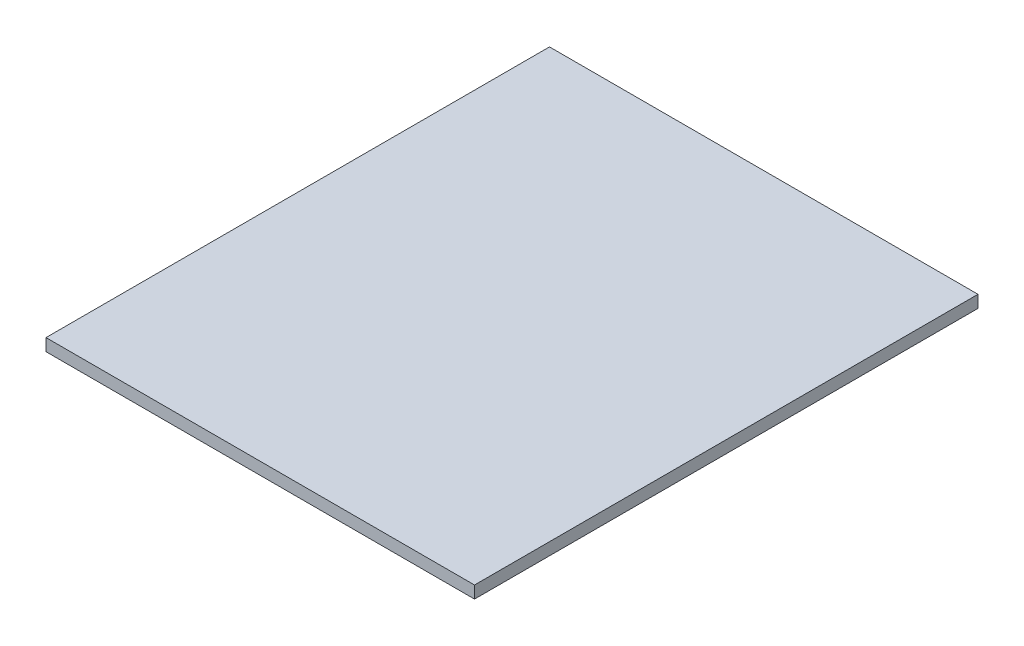
ISO-10303-21;
HEADER;
FILE_DESCRIPTION(('STEP AP214'),'2;1');
FILE_NAME('part.step','',(''),(''),'','','');
FILE_SCHEMA(('AUTOMOTIVE_DESIGN { 1 0 10303 214 1 1 1 1 }'));
ENDSEC;
DATA;
#1=APPLICATION_CONTEXT('core data for automotive mechanical design processes');
#2=APPLICATION_PROTOCOL_DEFINITION('international standard','automotive_design',2000,#1);
#3=PRODUCT_CONTEXT('',#1,'mechanical');
#4=PRODUCT('Part','Part','',(#3));
#5=PRODUCT_RELATED_PRODUCT_CATEGORY('part','',(#4));
#6=PRODUCT_DEFINITION_FORMATION('','',#4);
#7=PRODUCT_DEFINITION_CONTEXT('part definition',#1,'design');
#8=PRODUCT_DEFINITION('design','',#6,#7);
#9=PRODUCT_DEFINITION_SHAPE('','',#8);
#10=(LENGTH_UNIT() NAMED_UNIT(*) SI_UNIT(.MILLI.,.METRE.));
#11=(NAMED_UNIT(*) PLANE_ANGLE_UNIT() SI_UNIT($,.RADIAN.));
#12=(NAMED_UNIT(*) SI_UNIT($,.STERADIAN.) SOLID_ANGLE_UNIT());
#13=UNCERTAINTY_MEASURE_WITH_UNIT(LENGTH_MEASURE(1.E-05),#10,'distance_accuracy_value','');
#14=(GEOMETRIC_REPRESENTATION_CONTEXT(3) GLOBAL_UNCERTAINTY_ASSIGNED_CONTEXT((#13)) GLOBAL_UNIT_ASSIGNED_CONTEXT((#10,
#11,#12)) REPRESENTATION_CONTEXT('',''));
#15=CARTESIAN_POINT('',(0.,0.,0.));
#16=DIRECTION('',(0.,0.,1.));
#17=DIRECTION('',(1.,0.,0.));
#18=AXIS2_PLACEMENT_3D('',#15,#16,#17);
#19=CARTESIAN_POINT('',(0.,16.,0.));
#20=DIRECTION('',(1.,0.,0.));
#21=DIRECTION('',(0.,0.,-1.));
#22=AXIS2_PLACEMENT_3D('',#19,#20,#21);
#23=PLANE('',#22);
#24=DIRECTION('',(0.,0.,1.));
#25=VECTOR('',#24,1.);
#26=CARTESIAN_POINT('',(0.,0.,0.));
#27=LINE('',#26,#25);
#28=CARTESIAN_POINT('',(0.,0.,-658.));
#29=VERTEX_POINT('',#28);
#30=CARTESIAN_POINT('',(0.,0.,0.));
#31=VERTEX_POINT('',#30);
#32=EDGE_CURVE('E94',#29,#31,#27,.T.);
#33=ORIENTED_EDGE('',*,*,#32,.T.);
#34=DIRECTION('',(0.,-1.,0.));
#35=VECTOR('',#34,1.);
#36=CARTESIAN_POINT('',(0.,16.,0.));
#37=LINE('',#36,#35);
#38=CARTESIAN_POINT('',(0.,16.,0.));
#39=VERTEX_POINT('',#38);
#40=EDGE_CURVE('E11',#39,#31,#37,.T.);
#41=ORIENTED_EDGE('',*,*,#40,.F.);
#42=DIRECTION('',(0.,0.,1.));
#43=VECTOR('',#42,1.);
#44=CARTESIAN_POINT('',(0.,16.,0.));
#45=LINE('',#44,#43);
#46=CARTESIAN_POINT('',(0.,16.,-658.));
#47=VERTEX_POINT('',#46);
#48=EDGE_CURVE('E82',#47,#39,#45,.T.);
#49=ORIENTED_EDGE('',*,*,#48,.F.);
#50=DIRECTION('',(0.,-1.,0.));
#51=VECTOR('',#50,1.);
#52=CARTESIAN_POINT('',(0.,16.,-658.));
#53=LINE('',#52,#51);
#54=EDGE_CURVE('E90',#47,#29,#53,.T.);
#55=ORIENTED_EDGE('',*,*,#54,.T.);
#56=EDGE_LOOP('',(#33,#41,#49,#55));
#57=FACE_BOUND('',#56,.T.);
#58=ADVANCED_FACE('F31',(#57),#23,.F.);
#59=CARTESIAN_POINT('',(0.,16.,0.));
#60=DIRECTION('',(0.,0.,-1.));
#61=DIRECTION('',(-1.,0.,0.));
#62=AXIS2_PLACEMENT_3D('',#59,#60,#61);
#63=PLANE('',#62);
#64=DIRECTION('',(1.,0.,0.));
#65=VECTOR('',#64,1.);
#66=CARTESIAN_POINT('',(0.,0.,0.));
#67=LINE('',#66,#65);
#68=CARTESIAN_POINT('',(560.,0.,0.));
#69=VERTEX_POINT('',#68);
#70=EDGE_CURVE('E86',#31,#69,#67,.T.);
#71=ORIENTED_EDGE('',*,*,#70,.T.);
#72=DIRECTION('',(0.,-1.,0.));
#73=VECTOR('',#72,1.);
#74=CARTESIAN_POINT('',(560.,16.,0.));
#75=LINE('',#74,#73);
#76=CARTESIAN_POINT('',(560.,16.,0.));
#77=VERTEX_POINT('',#76);
#78=EDGE_CURVE('E39',#77,#69,#75,.T.);
#79=ORIENTED_EDGE('',*,*,#78,.F.);
#80=DIRECTION('',(1.,0.,0.));
#81=VECTOR('',#80,1.);
#82=CARTESIAN_POINT('',(0.,16.,0.));
#83=LINE('',#82,#81);
#84=EDGE_CURVE('E77',#39,#77,#83,.T.);
#85=ORIENTED_EDGE('',*,*,#84,.F.);
#86=ORIENTED_EDGE('',*,*,#40,.T.);
#87=EDGE_LOOP('',(#71,#79,#85,#86));
#88=FACE_BOUND('',#87,.T.);
#89=ADVANCED_FACE('F85',(#88),#63,.F.);
#90=CARTESIAN_POINT('',(560.,16.,0.));
#91=DIRECTION('',(-1.,0.,0.));
#92=DIRECTION('',(0.,0.,1.));
#93=AXIS2_PLACEMENT_3D('',#90,#91,#92);
#94=PLANE('',#93);
#95=DIRECTION('',(0.,0.,-1.));
#96=VECTOR('',#95,1.);
#97=CARTESIAN_POINT('',(560.,0.,0.));
#98=LINE('',#97,#96);
#99=CARTESIAN_POINT('',(560.,0.,-658.));
#100=VERTEX_POINT('',#99);
#101=EDGE_CURVE('E64',#69,#100,#98,.T.);
#102=ORIENTED_EDGE('',*,*,#101,.T.);
#103=DIRECTION('',(0.,-1.,0.));
#104=VECTOR('',#103,1.);
#105=CARTESIAN_POINT('',(560.,16.,-658.));
#106=LINE('',#105,#104);
#107=CARTESIAN_POINT('',(560.,16.,-658.));
#108=VERTEX_POINT('',#107);
#109=EDGE_CURVE('E87',#108,#100,#106,.T.);
#110=ORIENTED_EDGE('',*,*,#109,.F.);
#111=DIRECTION('',(0.,0.,-1.));
#112=VECTOR('',#111,1.);
#113=CARTESIAN_POINT('',(560.,16.,0.));
#114=LINE('',#113,#112);
#115=EDGE_CURVE('E80',#77,#108,#114,.T.);
#116=ORIENTED_EDGE('',*,*,#115,.F.);
#117=ORIENTED_EDGE('',*,*,#78,.T.);
#118=EDGE_LOOP('',(#102,#110,#116,#117));
#119=FACE_BOUND('',#118,.T.);
#120=ADVANCED_FACE('F88',(#119),#94,.F.);
#121=CARTESIAN_POINT('',(0.,16.,-658.));
#122=DIRECTION('',(0.,0.,1.));
#123=DIRECTION('',(1.,0.,0.));
#124=AXIS2_PLACEMENT_3D('',#121,#122,#123);
#125=PLANE('',#124);
#126=DIRECTION('',(-1.,0.,0.));
#127=VECTOR('',#126,1.);
#128=CARTESIAN_POINT('',(0.,0.,-658.));
#129=LINE('',#128,#127);
#130=EDGE_CURVE('E70',#100,#29,#129,.T.);
#131=ORIENTED_EDGE('',*,*,#130,.T.);
#132=ORIENTED_EDGE('',*,*,#54,.F.);
#133=DIRECTION('',(-1.,0.,0.));
#134=VECTOR('',#133,1.);
#135=CARTESIAN_POINT('',(0.,16.,-658.));
#136=LINE('',#135,#134);
#137=EDGE_CURVE('E47',#108,#47,#136,.T.);
#138=ORIENTED_EDGE('',*,*,#137,.F.);
#139=ORIENTED_EDGE('',*,*,#109,.T.);
#140=EDGE_LOOP('',(#131,#132,#138,#139));
#141=FACE_BOUND('',#140,.T.);
#142=ADVANCED_FACE('F101',(#141),#125,.F.);
#143=CARTESIAN_POINT('',(0.,16.,-658.));
#144=DIRECTION('',(0.,-1.,0.));
#145=DIRECTION('',(0.,0.,-1.));
#146=AXIS2_PLACEMENT_3D('',#143,#144,#145);
#147=PLANE('',#146);
#148=ORIENTED_EDGE('',*,*,#48,.T.);
#149=ORIENTED_EDGE('',*,*,#84,.T.);
#150=ORIENTED_EDGE('',*,*,#115,.T.);
#151=ORIENTED_EDGE('',*,*,#137,.T.);
#152=EDGE_LOOP('',(#148,#149,#150,#151));
#153=FACE_BOUND('',#152,.T.);
#154=ADVANCED_FACE('F78',(#153),#147,.F.);
#155=CARTESIAN_POINT('',(0.,0.,-658.));
#156=DIRECTION('',(0.,-1.,0.));
#157=DIRECTION('',(0.,0.,-1.));
#158=AXIS2_PLACEMENT_3D('',#155,#156,#157);
#159=PLANE('',#158);
#160=ORIENTED_EDGE('',*,*,#32,.F.);
#161=ORIENTED_EDGE('',*,*,#130,.F.);
#162=ORIENTED_EDGE('',*,*,#101,.F.);
#163=ORIENTED_EDGE('',*,*,#70,.F.);
#164=EDGE_LOOP('',(#160,#161,#162,#163));
#165=FACE_BOUND('',#164,.T.);
#166=ADVANCED_FACE('F104',(#165),#159,.T.);
#167=CLOSED_SHELL('',(#58,#89,#120,#142,#154,#166));
#168=MANIFOLD_SOLID_BREP('B2',#167);
#169=ADVANCED_BREP_SHAPE_REPRESENTATION('',(#18,#168),#14);
#170=SHAPE_DEFINITION_REPRESENTATION(#9,#169);
ENDSEC;
END-ISO-10303-21;
